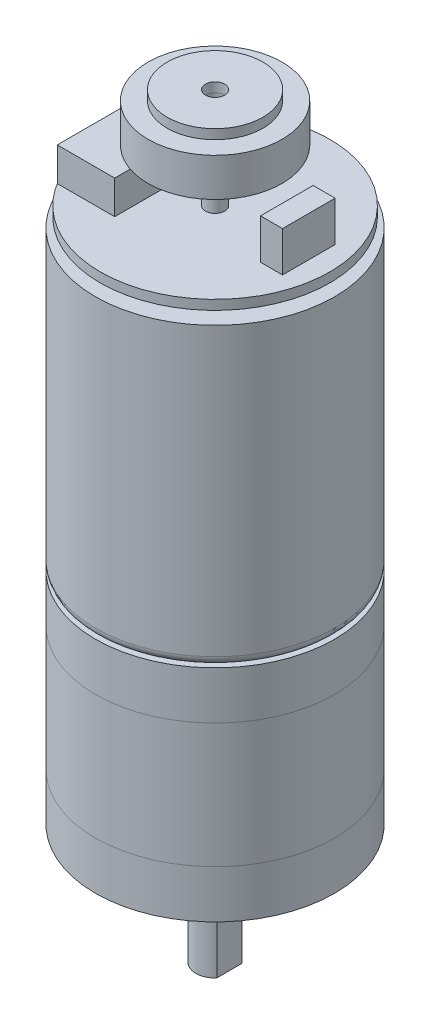
ISO-10303-21;
HEADER;
FILE_DESCRIPTION(('STEP AP214'),'2;1');
FILE_NAME('part.step','',(''),(''),'','','');
FILE_SCHEMA(('AUTOMOTIVE_DESIGN { 1 0 10303 214 1 1 1 1 }'));
ENDSEC;
DATA;
#1=APPLICATION_CONTEXT('core data for automotive mechanical design processes');
#2=APPLICATION_PROTOCOL_DEFINITION('international standard','automotive_design',2000,#1);
#3=PRODUCT_CONTEXT('',#1,'mechanical');
#4=PRODUCT('Part','Part','',(#3));
#5=PRODUCT_RELATED_PRODUCT_CATEGORY('part','',(#4));
#6=PRODUCT_DEFINITION_FORMATION('','',#4);
#7=PRODUCT_DEFINITION_CONTEXT('part definition',#1,'design');
#8=PRODUCT_DEFINITION('design','',#6,#7);
#9=PRODUCT_DEFINITION_SHAPE('','',#8);
#10=(LENGTH_UNIT() NAMED_UNIT(*) SI_UNIT(.MILLI.,.METRE.));
#11=(NAMED_UNIT(*) PLANE_ANGLE_UNIT() SI_UNIT($,.RADIAN.));
#12=(NAMED_UNIT(*) SI_UNIT($,.STERADIAN.) SOLID_ANGLE_UNIT());
#13=UNCERTAINTY_MEASURE_WITH_UNIT(LENGTH_MEASURE(1.E-05),#10,'distance_accuracy_value','');
#14=(GEOMETRIC_REPRESENTATION_CONTEXT(3) GLOBAL_UNCERTAINTY_ASSIGNED_CONTEXT((#13)) GLOBAL_UNIT_ASSIGNED_CONTEXT((#10,
#11,#12)) REPRESENTATION_CONTEXT('',''));
#15=CARTESIAN_POINT('',(0.,0.,0.));
#16=DIRECTION('',(0.,0.,1.));
#17=DIRECTION('',(1.,0.,0.));
#18=AXIS2_PLACEMENT_3D('',#15,#16,#17);
#19=CARTESIAN_POINT('',(9.8,60.2,2.75));
#20=DIRECTION('',(-1.,0.,0.));
#21=DIRECTION('',(0.,0.,1.));
#22=AXIS2_PLACEMENT_3D('',#19,#20,#21);
#23=PLANE('',#22);
#24=DIRECTION('',(0.,0.,-1.));
#25=VECTOR('',#24,1.);
#26=CARTESIAN_POINT('',(9.8,56.,2.75));
#27=LINE('',#26,#25);
#28=CARTESIAN_POINT('',(9.8,56.,2.75));
#29=VERTEX_POINT('',#28);
#30=CARTESIAN_POINT('',(9.8,56.,-2.75));
#31=VERTEX_POINT('',#30);
#32=EDGE_CURVE('E110',#29,#31,#27,.T.);
#33=ORIENTED_EDGE('',*,*,#32,.T.);
#34=DIRECTION('',(0.,-1.,0.));
#35=VECTOR('',#34,1.);
#36=CARTESIAN_POINT('',(9.8,60.2,-2.75));
#37=LINE('',#36,#35);
#38=CARTESIAN_POINT('',(9.8,60.2,-2.75));
#39=VERTEX_POINT('',#38);
#40=EDGE_CURVE('E12',#39,#31,#37,.T.);
#41=ORIENTED_EDGE('',*,*,#40,.F.);
#42=DIRECTION('',(0.,0.,-1.));
#43=VECTOR('',#42,1.);
#44=CARTESIAN_POINT('',(9.8,60.2,2.75));
#45=LINE('',#44,#43);
#46=CARTESIAN_POINT('',(9.8,60.2,2.75));
#47=VERTEX_POINT('',#46);
#48=EDGE_CURVE('E98',#47,#39,#45,.T.);
#49=ORIENTED_EDGE('',*,*,#48,.F.);
#50=DIRECTION('',(0.,-1.,0.));
#51=VECTOR('',#50,1.);
#52=CARTESIAN_POINT('',(9.8,60.2,2.75));
#53=LINE('',#52,#51);
#54=EDGE_CURVE('E106',#47,#29,#53,.T.);
#55=ORIENTED_EDGE('',*,*,#54,.T.);
#56=EDGE_LOOP('',(#33,#41,#49,#55));
#57=FACE_BOUND('',#56,.T.);
#58=ADVANCED_FACE('F47',(#57),#23,.F.);
#59=CARTESIAN_POINT('',(7.5,60.2,-2.75));
#60=DIRECTION('',(0.,0.,1.));
#61=DIRECTION('',(1.,0.,0.));
#62=AXIS2_PLACEMENT_3D('',#59,#60,#61);
#63=PLANE('',#62);
#64=DIRECTION('',(-1.,0.,0.));
#65=VECTOR('',#64,1.);
#66=CARTESIAN_POINT('',(7.5,56.,-2.75));
#67=LINE('',#66,#65);
#68=CARTESIAN_POINT('',(7.5,56.,-2.75));
#69=VERTEX_POINT('',#68);
#70=EDGE_CURVE('E102',#31,#69,#67,.T.);
#71=ORIENTED_EDGE('',*,*,#70,.T.);
#72=DIRECTION('',(0.,-1.,0.));
#73=VECTOR('',#72,1.);
#74=CARTESIAN_POINT('',(7.5,60.2,-2.75));
#75=LINE('',#74,#73);
#76=CARTESIAN_POINT('',(7.5,60.2,-2.75));
#77=VERTEX_POINT('',#76);
#78=EDGE_CURVE('E55',#77,#69,#75,.T.);
#79=ORIENTED_EDGE('',*,*,#78,.F.);
#80=DIRECTION('',(-1.,0.,0.));
#81=VECTOR('',#80,1.);
#82=CARTESIAN_POINT('',(7.5,60.2,-2.75));
#83=LINE('',#82,#81);
#84=EDGE_CURVE('E93',#39,#77,#83,.T.);
#85=ORIENTED_EDGE('',*,*,#84,.F.);
#86=ORIENTED_EDGE('',*,*,#40,.T.);
#87=EDGE_LOOP('',(#71,#79,#85,#86));
#88=FACE_BOUND('',#87,.T.);
#89=ADVANCED_FACE('F101',(#88),#63,.F.);
#90=CARTESIAN_POINT('',(7.5,60.2,2.75));
#91=DIRECTION('',(1.,0.,0.));
#92=DIRECTION('',(0.,0.,-1.));
#93=AXIS2_PLACEMENT_3D('',#90,#91,#92);
#94=PLANE('',#93);
#95=DIRECTION('',(0.,0.,1.));
#96=VECTOR('',#95,1.);
#97=CARTESIAN_POINT('',(7.5,56.,2.75));
#98=LINE('',#97,#96);
#99=CARTESIAN_POINT('',(7.5,56.,2.75));
#100=VERTEX_POINT('',#99);
#101=EDGE_CURVE('E80',#69,#100,#98,.T.);
#102=ORIENTED_EDGE('',*,*,#101,.T.);
#103=DIRECTION('',(0.,-1.,0.));
#104=VECTOR('',#103,1.);
#105=CARTESIAN_POINT('',(7.5,60.2,2.75));
#106=LINE('',#105,#104);
#107=CARTESIAN_POINT('',(7.5,60.2,2.75));
#108=VERTEX_POINT('',#107);
#109=EDGE_CURVE('E103',#108,#100,#106,.T.);
#110=ORIENTED_EDGE('',*,*,#109,.F.);
#111=DIRECTION('',(0.,0.,1.));
#112=VECTOR('',#111,1.);
#113=CARTESIAN_POINT('',(7.5,60.2,2.75));
#114=LINE('',#113,#112);
#115=EDGE_CURVE('E96',#77,#108,#114,.T.);
#116=ORIENTED_EDGE('',*,*,#115,.F.);
#117=ORIENTED_EDGE('',*,*,#78,.T.);
#118=EDGE_LOOP('',(#102,#110,#116,#117));
#119=FACE_BOUND('',#118,.T.);
#120=ADVANCED_FACE('F104',(#119),#94,.F.);
#121=CARTESIAN_POINT('',(7.5,60.2,2.75));
#122=DIRECTION('',(0.,0.,-1.));
#123=DIRECTION('',(-1.,0.,0.));
#124=AXIS2_PLACEMENT_3D('',#121,#122,#123);
#125=PLANE('',#124);
#126=DIRECTION('',(1.,0.,0.));
#127=VECTOR('',#126,1.);
#128=CARTESIAN_POINT('',(7.5,56.,2.75));
#129=LINE('',#128,#127);
#130=EDGE_CURVE('E86',#100,#29,#129,.T.);
#131=ORIENTED_EDGE('',*,*,#130,.T.);
#132=ORIENTED_EDGE('',*,*,#54,.F.);
#133=DIRECTION('',(1.,0.,0.));
#134=VECTOR('',#133,1.);
#135=CARTESIAN_POINT('',(7.5,60.2,2.75));
#136=LINE('',#135,#134);
#137=EDGE_CURVE('E63',#108,#47,#136,.T.);
#138=ORIENTED_EDGE('',*,*,#137,.F.);
#139=ORIENTED_EDGE('',*,*,#109,.T.);
#140=EDGE_LOOP('',(#131,#132,#138,#139));
#141=FACE_BOUND('',#140,.T.);
#142=ADVANCED_FACE('F117',(#141),#125,.F.);
#143=CARTESIAN_POINT('',(0.,60.2,0.));
#144=DIRECTION('',(0.,-1.,0.));
#145=DIRECTION('',(0.,0.,-1.));
#146=AXIS2_PLACEMENT_3D('',#143,#144,#145);
#147=PLANE('',#146);
#148=ORIENTED_EDGE('',*,*,#48,.T.);
#149=ORIENTED_EDGE('',*,*,#84,.T.);
#150=ORIENTED_EDGE('',*,*,#115,.T.);
#151=ORIENTED_EDGE('',*,*,#137,.T.);
#152=EDGE_LOOP('',(#148,#149,#150,#151));
#153=FACE_BOUND('',#152,.T.);
#154=ADVANCED_FACE('F94',(#153),#147,.F.);
#155=CARTESIAN_POINT('',(0.,56.,0.));
#156=DIRECTION('',(0.,-1.,0.));
#157=DIRECTION('',(0.,0.,-1.));
#158=AXIS2_PLACEMENT_3D('',#155,#156,#157);
#159=PLANE('',#158);
#160=ORIENTED_EDGE('',*,*,#32,.F.);
#161=ORIENTED_EDGE('',*,*,#130,.F.);
#162=ORIENTED_EDGE('',*,*,#101,.F.);
#163=ORIENTED_EDGE('',*,*,#70,.F.);
#164=EDGE_LOOP('',(#160,#161,#162,#163));
#165=FACE_BOUND('',#164,.T.);
#166=ADVANCED_FACE('F120',(#165),#159,.T.);
#167=CLOSED_SHELL('',(#58,#89,#120,#142,#154,#166));
#168=MANIFOLD_SOLID_BREP('B2',#167);
#169=CARTESIAN_POINT('',(-4.24390062427394,59.5,6.25));
#170=DIRECTION('',(-1.,0.,0.));
#171=DIRECTION('',(0.,0.,1.));
#172=AXIS2_PLACEMENT_3D('',#169,#170,#171);
#173=PLANE('',#172);
#174=DIRECTION('',(0.,0.,-1.));
#175=VECTOR('',#174,1.);
#176=CARTESIAN_POINT('',(-4.24390062427394,56.,6.25));
#177=LINE('',#176,#175);
#178=CARTESIAN_POINT('',(-4.24390062427394,56.,6.25));
#179=VERTEX_POINT('',#178);
#180=CARTESIAN_POINT('',(-4.24390062427394,56.,-6.25));
#181=VERTEX_POINT('',#180);
#182=EDGE_CURVE('E243',#179,#181,#177,.T.);
#183=ORIENTED_EDGE('',*,*,#182,.T.);
#184=DIRECTION('',(0.,-1.,0.));
#185=VECTOR('',#184,1.);
#186=CARTESIAN_POINT('',(-4.24390062427394,59.5,-6.25));
#187=LINE('',#186,#185);
#188=CARTESIAN_POINT('',(-4.24390062427394,59.5,-6.25));
#189=VERTEX_POINT('',#188);
#190=EDGE_CURVE('E45',#189,#181,#187,.T.);
#191=ORIENTED_EDGE('',*,*,#190,.F.);
#192=DIRECTION('',(0.,0.,-1.));
#193=VECTOR('',#192,1.);
#194=CARTESIAN_POINT('',(-4.24390062427394,59.5,6.25));
#195=LINE('',#194,#193);
#196=CARTESIAN_POINT('',(-4.24390062427394,59.5,6.25));
#197=VERTEX_POINT('',#196);
#198=EDGE_CURVE('E231',#197,#189,#195,.T.);
#199=ORIENTED_EDGE('',*,*,#198,.F.);
#200=DIRECTION('',(0.,-1.,0.));
#201=VECTOR('',#200,1.);
#202=CARTESIAN_POINT('',(-4.24390062427394,59.5,6.25));
#203=LINE('',#202,#201);
#204=EDGE_CURVE('E239',#197,#179,#203,.T.);
#205=ORIENTED_EDGE('',*,*,#204,.T.);
#206=EDGE_LOOP('',(#183,#191,#199,#205));
#207=FACE_BOUND('',#206,.T.);
#208=ADVANCED_FACE('F180',(#207),#173,.F.);
#209=CARTESIAN_POINT('',(-10.2439006242739,59.5,-6.25));
#210=DIRECTION('',(0.,0.,1.));
#211=DIRECTION('',(1.,0.,0.));
#212=AXIS2_PLACEMENT_3D('',#209,#210,#211);
#213=PLANE('',#212);
#214=DIRECTION('',(-1.,0.,0.));
#215=VECTOR('',#214,1.);
#216=CARTESIAN_POINT('',(-10.2439006242739,56.,-6.25));
#217=LINE('',#216,#215);
#218=CARTESIAN_POINT('',(-10.2439006242739,56.,-6.25));
#219=VERTEX_POINT('',#218);
#220=EDGE_CURVE('E235',#181,#219,#217,.T.);
#221=ORIENTED_EDGE('',*,*,#220,.T.);
#222=DIRECTION('',(0.,-1.,0.));
#223=VECTOR('',#222,1.);
#224=CARTESIAN_POINT('',(-10.2439006242739,59.5,-6.25));
#225=LINE('',#224,#223);
#226=CARTESIAN_POINT('',(-10.2439006242739,59.5,-6.25));
#227=VERTEX_POINT('',#226);
#228=EDGE_CURVE('E188',#227,#219,#225,.T.);
#229=ORIENTED_EDGE('',*,*,#228,.F.);
#230=DIRECTION('',(-1.,0.,0.));
#231=VECTOR('',#230,1.);
#232=CARTESIAN_POINT('',(-10.2439006242739,59.5,-6.25));
#233=LINE('',#232,#231);
#234=EDGE_CURVE('E226',#189,#227,#233,.T.);
#235=ORIENTED_EDGE('',*,*,#234,.F.);
#236=ORIENTED_EDGE('',*,*,#190,.T.);
#237=EDGE_LOOP('',(#221,#229,#235,#236));
#238=FACE_BOUND('',#237,.T.);
#239=ADVANCED_FACE('F234',(#238),#213,.F.);
#240=CARTESIAN_POINT('',(-10.2439006242739,59.5,6.25));
#241=DIRECTION('',(1.,0.,0.));
#242=DIRECTION('',(0.,0.,-1.));
#243=AXIS2_PLACEMENT_3D('',#240,#241,#242);
#244=PLANE('',#243);
#245=DIRECTION('',(0.,0.,1.));
#246=VECTOR('',#245,1.);
#247=CARTESIAN_POINT('',(-10.2439006242739,56.,6.25));
#248=LINE('',#247,#246);
#249=CARTESIAN_POINT('',(-10.2439006242739,56.,6.25));
#250=VERTEX_POINT('',#249);
#251=EDGE_CURVE('E213',#219,#250,#248,.T.);
#252=ORIENTED_EDGE('',*,*,#251,.T.);
#253=DIRECTION('',(0.,-1.,0.));
#254=VECTOR('',#253,1.);
#255=CARTESIAN_POINT('',(-10.2439006242739,59.5,6.25));
#256=LINE('',#255,#254);
#257=CARTESIAN_POINT('',(-10.2439006242739,59.5,6.25));
#258=VERTEX_POINT('',#257);
#259=EDGE_CURVE('E236',#258,#250,#256,.T.);
#260=ORIENTED_EDGE('',*,*,#259,.F.);
#261=DIRECTION('',(0.,0.,1.));
#262=VECTOR('',#261,1.);
#263=CARTESIAN_POINT('',(-10.2439006242739,59.5,6.25));
#264=LINE('',#263,#262);
#265=EDGE_CURVE('E229',#227,#258,#264,.T.);
#266=ORIENTED_EDGE('',*,*,#265,.F.);
#267=ORIENTED_EDGE('',*,*,#228,.T.);
#268=EDGE_LOOP('',(#252,#260,#266,#267));
#269=FACE_BOUND('',#268,.T.);
#270=ADVANCED_FACE('F237',(#269),#244,.F.);
#271=CARTESIAN_POINT('',(-10.2439006242739,59.5,6.25));
#272=DIRECTION('',(0.,0.,-1.));
#273=DIRECTION('',(-1.,0.,0.));
#274=AXIS2_PLACEMENT_3D('',#271,#272,#273);
#275=PLANE('',#274);
#276=DIRECTION('',(1.,0.,0.));
#277=VECTOR('',#276,1.);
#278=CARTESIAN_POINT('',(-10.2439006242739,56.,6.25));
#279=LINE('',#278,#277);
#280=EDGE_CURVE('E219',#250,#179,#279,.T.);
#281=ORIENTED_EDGE('',*,*,#280,.T.);
#282=ORIENTED_EDGE('',*,*,#204,.F.);
#283=DIRECTION('',(1.,0.,0.));
#284=VECTOR('',#283,1.);
#285=CARTESIAN_POINT('',(-10.2439006242739,59.5,6.25));
#286=LINE('',#285,#284);
#287=EDGE_CURVE('E196',#258,#197,#286,.T.);
#288=ORIENTED_EDGE('',*,*,#287,.F.);
#289=ORIENTED_EDGE('',*,*,#259,.T.);
#290=EDGE_LOOP('',(#281,#282,#288,#289));
#291=FACE_BOUND('',#290,.T.);
#292=ADVANCED_FACE('F250',(#291),#275,.F.);
#293=CARTESIAN_POINT('',(0.,59.5,0.));
#294=DIRECTION('',(0.,-1.,0.));
#295=DIRECTION('',(0.,0.,-1.));
#296=AXIS2_PLACEMENT_3D('',#293,#294,#295);
#297=PLANE('',#296);
#298=ORIENTED_EDGE('',*,*,#198,.T.);
#299=ORIENTED_EDGE('',*,*,#234,.T.);
#300=ORIENTED_EDGE('',*,*,#265,.T.);
#301=ORIENTED_EDGE('',*,*,#287,.T.);
#302=EDGE_LOOP('',(#298,#299,#300,#301));
#303=FACE_BOUND('',#302,.T.);
#304=ADVANCED_FACE('F227',(#303),#297,.F.);
#305=CARTESIAN_POINT('',(0.,56.,0.));
#306=DIRECTION('',(0.,-1.,0.));
#307=DIRECTION('',(0.,0.,-1.));
#308=AXIS2_PLACEMENT_3D('',#305,#306,#307);
#309=PLANE('',#308);
#310=ORIENTED_EDGE('',*,*,#182,.F.);
#311=ORIENTED_EDGE('',*,*,#280,.F.);
#312=ORIENTED_EDGE('',*,*,#251,.F.);
#313=ORIENTED_EDGE('',*,*,#220,.F.);
#314=EDGE_LOOP('',(#310,#311,#312,#313));
#315=FACE_BOUND('',#314,.T.);
#316=ADVANCED_FACE('F253',(#315),#309,.T.);
#317=CLOSED_SHELL('',(#208,#239,#270,#292,#304,#316));
#318=MANIFOLD_SOLID_BREP('B6',#317);
#319=CARTESIAN_POINT('',(0.,-12.5,0.));
#320=DIRECTION('',(0.,1.,0.));
#321=DIRECTION('',(0.,0.,1.));
#322=AXIS2_PLACEMENT_3D('',#319,#320,#321);
#323=CYLINDRICAL_SURFACE('',#322,2.);
#324=CARTESIAN_POINT('',(0.,-12.5,0.));
#325=DIRECTION('',(0.,-1.,0.));
#326=DIRECTION('',(0.,0.,-1.));
#327=AXIS2_PLACEMENT_3D('',#324,#325,#326);
#328=CIRCLE('',#327,2.);
#329=CARTESIAN_POINT('',(1.5,-12.5,1.3228756555323));
#330=VERTEX_POINT('',#329);
#331=CARTESIAN_POINT('',(1.5,-12.5,-1.32287565553229));
#332=VERTEX_POINT('',#331);
#333=EDGE_CURVE('E178',#330,#332,#328,.T.);
#334=ORIENTED_EDGE('',*,*,#333,.F.);
#335=DIRECTION('',(0.,-1.,0.));
#336=VECTOR('',#335,1.);
#337=CARTESIAN_POINT('',(1.5,-4.7,1.3228756555323));
#338=LINE('',#337,#336);
#339=CARTESIAN_POINT('',(1.5,-4.7,1.3228756555323));
#340=VERTEX_POINT('',#339);
#341=EDGE_CURVE('E325',#340,#330,#338,.T.);
#342=ORIENTED_EDGE('',*,*,#341,.F.);
#343=CARTESIAN_POINT('',(0.,-4.7,0.));
#344=DIRECTION('',(0.,-1.,0.));
#345=DIRECTION('',(0.,0.,-1.));
#346=AXIS2_PLACEMENT_3D('',#343,#344,#345);
#347=CIRCLE('',#346,2.);
#348=CARTESIAN_POINT('',(1.5,-4.7,-1.32287565553229));
#349=VERTEX_POINT('',#348);
#350=EDGE_CURVE('E340',#349,#340,#347,.T.);
#351=ORIENTED_EDGE('',*,*,#350,.F.);
#352=DIRECTION('',(0.,-1.,0.));
#353=VECTOR('',#352,1.);
#354=CARTESIAN_POINT('',(1.5,-4.7,-1.32287565553229));
#355=LINE('',#354,#353);
#356=EDGE_CURVE('E331',#349,#332,#355,.T.);
#357=ORIENTED_EDGE('',*,*,#356,.T.);
#358=EDGE_LOOP('',(#334,#342,#351,#357));
#359=FACE_BOUND('',#358,.T.);
#360=CARTESIAN_POINT('',(0.,-2.5,0.));
#361=DIRECTION('',(0.,-1.,0.));
#362=DIRECTION('',(0.,0.,-1.));
#363=AXIS2_PLACEMENT_3D('',#360,#361,#362);
#364=CIRCLE('',#363,2.);
#365=CARTESIAN_POINT('',(0.,-2.5,-2.));
#366=VERTEX_POINT('',#365);
#367=EDGE_CURVE('E314',#366,#366,#364,.T.);
#368=ORIENTED_EDGE('',*,*,#367,.T.);
#369=EDGE_LOOP('',(#368));
#370=FACE_BOUND('',#369,.T.);
#371=ADVANCED_FACE('F311',(#359,#370),#323,.T.);
#372=CARTESIAN_POINT('',(0.,-12.5,0.));
#373=DIRECTION('',(0.,-1.,0.));
#374=DIRECTION('',(0.,0.,-1.));
#375=AXIS2_PLACEMENT_3D('',#372,#373,#374);
#376=PLANE('',#375);
#377=DIRECTION('',(0.,0.,-1.));
#378=VECTOR('',#377,1.);
#379=CARTESIAN_POINT('',(1.5,-12.5,1.3228756555323));
#380=LINE('',#379,#378);
#381=EDGE_CURVE('E336',#330,#332,#380,.T.);
#382=ORIENTED_EDGE('',*,*,#381,.F.);
#383=ORIENTED_EDGE('',*,*,#333,.T.);
#384=EDGE_LOOP('',(#382,#383));
#385=FACE_BOUND('',#384,.T.);
#386=ADVANCED_FACE('F346',(#385),#376,.T.);
#387=CARTESIAN_POINT('',(0.,-2.5,0.));
#388=DIRECTION('',(0.,-1.,0.));
#389=DIRECTION('',(0.,0.,-1.));
#390=AXIS2_PLACEMENT_3D('',#387,#388,#389);
#391=PLANE('',#390);
#392=ORIENTED_EDGE('',*,*,#367,.F.);
#393=EDGE_LOOP('',(#392));
#394=FACE_BOUND('',#393,.T.);
#395=ADVANCED_FACE('F348',(#394),#391,.F.);
#396=CARTESIAN_POINT('',(1.5,-4.7,1.3228756555323));
#397=DIRECTION('',(-1.,0.,0.));
#398=DIRECTION('',(0.,0.,1.));
#399=AXIS2_PLACEMENT_3D('',#396,#397,#398);
#400=PLANE('',#399);
#401=ORIENTED_EDGE('',*,*,#381,.T.);
#402=ORIENTED_EDGE('',*,*,#356,.F.);
#403=DIRECTION('',(0.,0.,-1.));
#404=VECTOR('',#403,1.);
#405=CARTESIAN_POINT('',(1.5,-4.7,1.3228756555323));
#406=LINE('',#405,#404);
#407=EDGE_CURVE('E363',#340,#349,#406,.T.);
#408=ORIENTED_EDGE('',*,*,#407,.F.);
#409=ORIENTED_EDGE('',*,*,#341,.T.);
#410=EDGE_LOOP('',(#401,#402,#408,#409));
#411=FACE_BOUND('',#410,.T.);
#412=ADVANCED_FACE('F337',(#411),#400,.F.);
#413=CARTESIAN_POINT('',(0.,-4.7,0.));
#414=DIRECTION('',(0.,-1.,0.));
#415=DIRECTION('',(0.,0.,-1.));
#416=AXIS2_PLACEMENT_3D('',#413,#414,#415);
#417=PLANE('',#416);
#418=ORIENTED_EDGE('',*,*,#350,.T.);
#419=ORIENTED_EDGE('',*,*,#407,.T.);
#420=EDGE_LOOP('',(#418,#419));
#421=FACE_BOUND('',#420,.T.);
#422=ADVANCED_FACE('F358',(#421),#417,.T.);
#423=CLOSED_SHELL('',(#371,#386,#395,#412,#422));
#424=MANIFOLD_SOLID_BREP('B39',#423);
#425=CARTESIAN_POINT('',(0.,-2.5,0.));
#426=DIRECTION('',(0.,1.,0.));
#427=DIRECTION('',(0.,0.,1.));
#428=AXIS2_PLACEMENT_3D('',#425,#426,#427);
#429=CYLINDRICAL_SURFACE('',#428,3.5);
#430=CARTESIAN_POINT('',(0.,-2.5,0.));
#431=DIRECTION('',(0.,-1.,0.));
#432=DIRECTION('',(0.,0.,-1.));
#433=AXIS2_PLACEMENT_3D('',#430,#431,#432);
#434=CIRCLE('',#433,3.5);
#435=CARTESIAN_POINT('',(0.,-2.5,-3.5));
#436=VERTEX_POINT('',#435);
#437=EDGE_CURVE('E310',#436,#436,#434,.T.);
#438=ORIENTED_EDGE('',*,*,#437,.F.);
#439=EDGE_LOOP('',(#438));
#440=FACE_BOUND('',#439,.T.);
#441=CARTESIAN_POINT('',(0.,0.,0.));
#442=DIRECTION('',(0.,-1.,0.));
#443=DIRECTION('',(0.,0.,-1.));
#444=AXIS2_PLACEMENT_3D('',#441,#442,#443);
#445=CIRCLE('',#444,3.5);
#446=CARTESIAN_POINT('',(0.,0.,-3.5));
#447=VERTEX_POINT('',#446);
#448=EDGE_CURVE('E408',#447,#447,#445,.T.);
#449=ORIENTED_EDGE('',*,*,#448,.T.);
#450=EDGE_LOOP('',(#449));
#451=FACE_BOUND('',#450,.T.);
#452=ADVANCED_FACE('F405',(#440,#451),#429,.T.);
#453=CARTESIAN_POINT('',(0.,-2.5,0.));
#454=DIRECTION('',(0.,-1.,0.));
#455=DIRECTION('',(0.,0.,-1.));
#456=AXIS2_PLACEMENT_3D('',#453,#454,#455);
#457=PLANE('',#456);
#458=ORIENTED_EDGE('',*,*,#437,.T.);
#459=EDGE_LOOP('',(#458));
#460=FACE_BOUND('',#459,.T.);
#461=ADVANCED_FACE('F420',(#460),#457,.T.);
#462=CARTESIAN_POINT('',(0.,0.,0.));
#463=DIRECTION('',(0.,-1.,0.));
#464=DIRECTION('',(0.,0.,-1.));
#465=AXIS2_PLACEMENT_3D('',#462,#463,#464);
#466=PLANE('',#465);
#467=ORIENTED_EDGE('',*,*,#448,.F.);
#468=EDGE_LOOP('',(#467));
#469=FACE_BOUND('',#468,.T.);
#470=ADVANCED_FACE('F418',(#469),#466,.F.);
#471=CLOSED_SHELL('',(#452,#461,#470));
#472=MANIFOLD_SOLID_BREP('B172',#471);
#473=CARTESIAN_POINT('',(0.,66.5,0.));
#474=DIRECTION('',(0.,-1.,0.));
#475=DIRECTION('',(0.,0.,-1.));
#476=AXIS2_PLACEMENT_3D('',#473,#474,#475);
#477=CYLINDRICAL_SURFACE('',#476,5.);
#478=CARTESIAN_POINT('',(0.,66.5,0.));
#479=DIRECTION('',(0.,1.,0.));
#480=DIRECTION('',(0.,0.,1.));
#481=AXIS2_PLACEMENT_3D('',#478,#479,#480);
#482=CIRCLE('',#481,5.);
#483=CARTESIAN_POINT('',(0.,66.5,5.));
#484=VERTEX_POINT('',#483);
#485=EDGE_CURVE('E404',#484,#484,#482,.T.);
#486=ORIENTED_EDGE('',*,*,#485,.F.);
#487=EDGE_LOOP('',(#486));
#488=FACE_BOUND('',#487,.T.);
#489=CARTESIAN_POINT('',(0.,65.5,0.));
#490=DIRECTION('',(0.,1.,0.));
#491=DIRECTION('',(0.,0.,1.));
#492=AXIS2_PLACEMENT_3D('',#489,#490,#491);
#493=CIRCLE('',#492,5.);
#494=CARTESIAN_POINT('',(0.,65.5,5.));
#495=VERTEX_POINT('',#494);
#496=EDGE_CURVE('E460',#495,#495,#493,.T.);
#497=ORIENTED_EDGE('',*,*,#496,.T.);
#498=EDGE_LOOP('',(#497));
#499=FACE_BOUND('',#498,.T.);
#500=ADVANCED_FACE('F453',(#488,#499),#477,.T.);
#501=CARTESIAN_POINT('',(0.,66.5,0.));
#502=DIRECTION('',(0.,1.,0.));
#503=DIRECTION('',(0.,0.,1.));
#504=AXIS2_PLACEMENT_3D('',#501,#502,#503);
#505=PLANE('',#504);
#506=CARTESIAN_POINT('',(0.,66.5,0.));
#507=DIRECTION('',(0.,1.,0.));
#508=DIRECTION('',(0.,0.,1.));
#509=AXIS2_PLACEMENT_3D('',#506,#507,#508);
#510=CIRCLE('',#509,1.);
#511=CARTESIAN_POINT('',(0.,66.5,1.));
#512=VERTEX_POINT('',#511);
#513=EDGE_CURVE('E466',#512,#512,#510,.T.);
#514=ORIENTED_EDGE('',*,*,#513,.F.);
#515=EDGE_LOOP('',(#514));
#516=FACE_BOUND('',#515,.T.);
#517=ORIENTED_EDGE('',*,*,#485,.T.);
#518=EDGE_LOOP('',(#517));
#519=FACE_BOUND('',#518,.T.);
#520=ADVANCED_FACE('F482',(#516,#519),#505,.T.);
#521=CARTESIAN_POINT('',(0.,65.5,0.));
#522=DIRECTION('',(0.,1.,0.));
#523=DIRECTION('',(0.,0.,1.));
#524=AXIS2_PLACEMENT_3D('',#521,#522,#523);
#525=PLANE('',#524);
#526=CARTESIAN_POINT('',(0.,65.5,0.));
#527=DIRECTION('',(0.,1.,0.));
#528=DIRECTION('',(0.,0.,1.));
#529=AXIS2_PLACEMENT_3D('',#526,#527,#528);
#530=CIRCLE('',#529,1.);
#531=CARTESIAN_POINT('',(0.,65.5,1.));
#532=VERTEX_POINT('',#531);
#533=EDGE_CURVE('E456',#532,#532,#530,.T.);
#534=ORIENTED_EDGE('',*,*,#533,.T.);
#535=EDGE_LOOP('',(#534));
#536=FACE_BOUND('',#535,.T.);
#537=ORIENTED_EDGE('',*,*,#496,.F.);
#538=EDGE_LOOP('',(#537));
#539=FACE_BOUND('',#538,.T.);
#540=ADVANCED_FACE('F473',(#536,#539),#525,.F.);
#541=CARTESIAN_POINT('',(0.,64.5,0.));
#542=DIRECTION('',(0.,1.,0.));
#543=DIRECTION('',(0.,0.,1.));
#544=AXIS2_PLACEMENT_3D('',#541,#542,#543);
#545=CYLINDRICAL_SURFACE('',#544,1.);
#546=ORIENTED_EDGE('',*,*,#513,.T.);
#547=EDGE_LOOP('',(#546));
#548=FACE_BOUND('',#547,.T.);
#549=ORIENTED_EDGE('',*,*,#533,.F.);
#550=EDGE_LOOP('',(#549));
#551=FACE_BOUND('',#550,.T.);
#552=ADVANCED_FACE('F476',(#548,#551),#545,.F.);
#553=CLOSED_SHELL('',(#500,#520,#540,#552));
#554=MANIFOLD_SOLID_BREP('B305',#553);
#555=CARTESIAN_POINT('',(0.,65.5,0.));
#556=DIRECTION('',(0.,-1.,0.));
#557=DIRECTION('',(0.,0.,-1.));
#558=AXIS2_PLACEMENT_3D('',#555,#556,#557);
#559=CYLINDRICAL_SURFACE('',#558,7.);
#560=CARTESIAN_POINT('',(0.,65.5,0.));
#561=DIRECTION('',(0.,1.,0.));
#562=DIRECTION('',(0.,0.,1.));
#563=AXIS2_PLACEMENT_3D('',#560,#561,#562);
#564=CIRCLE('',#563,7.);
#565=CARTESIAN_POINT('',(0.,65.5,7.));
#566=VERTEX_POINT('',#565);
#567=EDGE_CURVE('E452',#566,#566,#564,.T.);
#568=ORIENTED_EDGE('',*,*,#567,.F.);
#569=EDGE_LOOP('',(#568));
#570=FACE_BOUND('',#569,.T.);
#571=CARTESIAN_POINT('',(0.,61.5,0.));
#572=DIRECTION('',(0.,1.,0.));
#573=DIRECTION('',(0.,0.,1.));
#574=AXIS2_PLACEMENT_3D('',#571,#572,#573);
#575=CIRCLE('',#574,7.);
#576=CARTESIAN_POINT('',(0.,61.5,7.));
#577=VERTEX_POINT('',#576);
#578=EDGE_CURVE('E529',#577,#577,#575,.T.);
#579=ORIENTED_EDGE('',*,*,#578,.T.);
#580=EDGE_LOOP('',(#579));
#581=FACE_BOUND('',#580,.T.);
#582=ADVANCED_FACE('F522',(#570,#581),#559,.T.);
#583=CARTESIAN_POINT('',(0.,65.5,0.));
#584=DIRECTION('',(0.,1.,0.));
#585=DIRECTION('',(0.,0.,1.));
#586=AXIS2_PLACEMENT_3D('',#583,#584,#585);
#587=PLANE('',#586);
#588=CARTESIAN_POINT('',(0.,65.5,0.));
#589=DIRECTION('',(0.,1.,0.));
#590=DIRECTION('',(0.,0.,1.));
#591=AXIS2_PLACEMENT_3D('',#588,#589,#590);
#592=CIRCLE('',#591,1.);
#593=CARTESIAN_POINT('',(0.,65.5,1.));
#594=VERTEX_POINT('',#593);
#595=EDGE_CURVE('E525',#594,#594,#592,.T.);
#596=ORIENTED_EDGE('',*,*,#595,.F.);
#597=EDGE_LOOP('',(#596));
#598=FACE_BOUND('',#597,.T.);
#599=ORIENTED_EDGE('',*,*,#567,.T.);
#600=EDGE_LOOP('',(#599));
#601=FACE_BOUND('',#600,.T.);
#602=ADVANCED_FACE('F545',(#598,#601),#587,.T.);
#603=CARTESIAN_POINT('',(0.,61.5,0.));
#604=DIRECTION('',(0.,1.,0.));
#605=DIRECTION('',(0.,0.,1.));
#606=AXIS2_PLACEMENT_3D('',#603,#604,#605);
#607=PLANE('',#606);
#608=ORIENTED_EDGE('',*,*,#578,.F.);
#609=EDGE_LOOP('',(#608));
#610=FACE_BOUND('',#609,.T.);
#611=ADVANCED_FACE('F547',(#610),#607,.F.);
#612=CARTESIAN_POINT('',(0.,64.5,0.));
#613=DIRECTION('',(0.,1.,0.));
#614=DIRECTION('',(0.,0.,1.));
#615=AXIS2_PLACEMENT_3D('',#612,#613,#614);
#616=CYLINDRICAL_SURFACE('',#615,1.);
#617=ORIENTED_EDGE('',*,*,#595,.T.);
#618=EDGE_LOOP('',(#617));
#619=FACE_BOUND('',#618,.T.);
#620=CARTESIAN_POINT('',(0.,64.5,0.));
#621=DIRECTION('',(0.,1.,0.));
#622=DIRECTION('',(0.,0.,1.));
#623=AXIS2_PLACEMENT_3D('',#620,#621,#622);
#624=CIRCLE('',#623,1.);
#625=CARTESIAN_POINT('',(0.,64.5,1.));
#626=VERTEX_POINT('',#625);
#627=EDGE_CURVE('E535',#626,#626,#624,.T.);
#628=ORIENTED_EDGE('',*,*,#627,.F.);
#629=EDGE_LOOP('',(#628));
#630=FACE_BOUND('',#629,.T.);
#631=ADVANCED_FACE('F542',(#619,#630),#616,.F.);
#632=CARTESIAN_POINT('',(0.,64.5,0.));
#633=DIRECTION('',(0.,1.,0.));
#634=DIRECTION('',(0.,0.,1.));
#635=AXIS2_PLACEMENT_3D('',#632,#633,#634);
#636=PLANE('',#635);
#637=ORIENTED_EDGE('',*,*,#627,.T.);
#638=EDGE_LOOP('',(#637));
#639=FACE_BOUND('',#638,.T.);
#640=ADVANCED_FACE('F558',(#639),#636,.T.);
#641=CLOSED_SHELL('',(#582,#602,#611,#631,#640));
#642=MANIFOLD_SOLID_BREP('B399',#641);
#643=CARTESIAN_POINT('',(0.,61.5,0.));
#644=DIRECTION('',(0.,-1.,0.));
#645=DIRECTION('',(0.,0.,-1.));
#646=AXIS2_PLACEMENT_3D('',#643,#644,#645);
#647=CYLINDRICAL_SURFACE('',#646,4.);
#648=CARTESIAN_POINT('',(0.,61.5,0.));
#649=DIRECTION('',(0.,1.,0.));
#650=DIRECTION('',(0.,0.,1.));
#651=AXIS2_PLACEMENT_3D('',#648,#649,#650);
#652=CIRCLE('',#651,4.);
#653=CARTESIAN_POINT('',(0.,61.5,4.));
#654=VERTEX_POINT('',#653);
#655=EDGE_CURVE('E521',#654,#654,#652,.T.);
#656=ORIENTED_EDGE('',*,*,#655,.F.);
#657=EDGE_LOOP('',(#656));
#658=FACE_BOUND('',#657,.T.);
#659=CARTESIAN_POINT('',(0.,61.,0.));
#660=DIRECTION('',(0.,1.,0.));
#661=DIRECTION('',(0.,0.,1.));
#662=AXIS2_PLACEMENT_3D('',#659,#660,#661);
#663=CIRCLE('',#662,4.);
#664=CARTESIAN_POINT('',(0.,61.,4.));
#665=VERTEX_POINT('',#664);
#666=EDGE_CURVE('E603',#665,#665,#663,.T.);
#667=ORIENTED_EDGE('',*,*,#666,.T.);
#668=EDGE_LOOP('',(#667));
#669=FACE_BOUND('',#668,.T.);
#670=ADVANCED_FACE('F600',(#658,#669),#647,.T.);
#671=CARTESIAN_POINT('',(0.,61.5,0.));
#672=DIRECTION('',(0.,1.,0.));
#673=DIRECTION('',(0.,0.,1.));
#674=AXIS2_PLACEMENT_3D('',#671,#672,#673);
#675=PLANE('',#674);
#676=ORIENTED_EDGE('',*,*,#655,.T.);
#677=EDGE_LOOP('',(#676));
#678=FACE_BOUND('',#677,.T.);
#679=ADVANCED_FACE('F615',(#678),#675,.T.);
#680=CARTESIAN_POINT('',(0.,61.,0.));
#681=DIRECTION('',(0.,1.,0.));
#682=DIRECTION('',(0.,0.,1.));
#683=AXIS2_PLACEMENT_3D('',#680,#681,#682);
#684=PLANE('',#683);
#685=ORIENTED_EDGE('',*,*,#666,.F.);
#686=EDGE_LOOP('',(#685));
#687=FACE_BOUND('',#686,.T.);
#688=ADVANCED_FACE('F613',(#687),#684,.F.);
#689=CLOSED_SHELL('',(#670,#679,#688));
#690=MANIFOLD_SOLID_BREP('B447',#689);
#691=CARTESIAN_POINT('',(0.,61.,0.));
#692=DIRECTION('',(0.,-1.,0.));
#693=DIRECTION('',(0.,0.,-1.));
#694=AXIS2_PLACEMENT_3D('',#691,#692,#693);
#695=CYLINDRICAL_SURFACE('',#694,1.);
#696=CARTESIAN_POINT('',(0.,61.,0.));
#697=DIRECTION('',(0.,1.,0.));
#698=DIRECTION('',(0.,0.,1.));
#699=AXIS2_PLACEMENT_3D('',#696,#697,#698);
#700=CIRCLE('',#699,1.);
#701=CARTESIAN_POINT('',(0.,61.,1.));
#702=VERTEX_POINT('',#701);
#703=EDGE_CURVE('E599',#702,#702,#700,.T.);
#704=ORIENTED_EDGE('',*,*,#703,.F.);
#705=EDGE_LOOP('',(#704));
#706=FACE_BOUND('',#705,.T.);
#707=CARTESIAN_POINT('',(0.,56.,0.));
#708=DIRECTION('',(0.,1.,0.));
#709=DIRECTION('',(0.,0.,1.));
#710=AXIS2_PLACEMENT_3D('',#707,#708,#709);
#711=CIRCLE('',#710,1.);
#712=CARTESIAN_POINT('',(0.,56.,1.));
#713=VERTEX_POINT('',#712);
#714=EDGE_CURVE('E651',#713,#713,#711,.T.);
#715=ORIENTED_EDGE('',*,*,#714,.T.);
#716=EDGE_LOOP('',(#715));
#717=FACE_BOUND('',#716,.T.);
#718=ADVANCED_FACE('F648',(#706,#717),#695,.T.);
#719=CARTESIAN_POINT('',(0.,61.,0.));
#720=DIRECTION('',(0.,1.,0.));
#721=DIRECTION('',(0.,0.,1.));
#722=AXIS2_PLACEMENT_3D('',#719,#720,#721);
#723=PLANE('',#722);
#724=ORIENTED_EDGE('',*,*,#703,.T.);
#725=EDGE_LOOP('',(#724));
#726=FACE_BOUND('',#725,.T.);
#727=ADVANCED_FACE('F663',(#726),#723,.T.);
#728=CARTESIAN_POINT('',(0.,56.,0.));
#729=DIRECTION('',(0.,1.,0.));
#730=DIRECTION('',(0.,0.,1.));
#731=AXIS2_PLACEMENT_3D('',#728,#729,#730);
#732=PLANE('',#731);
#733=ORIENTED_EDGE('',*,*,#714,.F.);
#734=EDGE_LOOP('',(#733));
#735=FACE_BOUND('',#734,.T.);
#736=ADVANCED_FACE('F661',(#735),#732,.F.);
#737=CLOSED_SHELL('',(#718,#727,#736));
#738=MANIFOLD_SOLID_BREP('B516',#737);
#739=CARTESIAN_POINT('',(0.,56.,0.));
#740=DIRECTION('',(0.,-1.,0.));
#741=DIRECTION('',(0.,0.,-1.));
#742=AXIS2_PLACEMENT_3D('',#739,#740,#741);
#743=CYLINDRICAL_SURFACE('',#742,12.);
#744=CARTESIAN_POINT('',(0.,56.,0.));
#745=DIRECTION('',(0.,1.,0.));
#746=DIRECTION('',(0.,0.,1.));
#747=AXIS2_PLACEMENT_3D('',#744,#745,#746);
#748=CIRCLE('',#747,12.);
#749=CARTESIAN_POINT('',(0.,56.,12.));
#750=VERTEX_POINT('',#749);
#751=EDGE_CURVE('E647',#750,#750,#748,.T.);
#752=ORIENTED_EDGE('',*,*,#751,.F.);
#753=EDGE_LOOP('',(#752));
#754=FACE_BOUND('',#753,.T.);
#755=CARTESIAN_POINT('',(0.,55.,0.));
#756=DIRECTION('',(0.,1.,0.));
#757=DIRECTION('',(0.,0.,1.));
#758=AXIS2_PLACEMENT_3D('',#755,#756,#757);
#759=CIRCLE('',#758,12.);
#760=CARTESIAN_POINT('',(0.,55.,12.));
#761=VERTEX_POINT('',#760);
#762=EDGE_CURVE('E699',#761,#761,#759,.T.);
#763=ORIENTED_EDGE('',*,*,#762,.T.);
#764=EDGE_LOOP('',(#763));
#765=FACE_BOUND('',#764,.T.);
#766=ADVANCED_FACE('F696',(#754,#765),#743,.T.);
#767=CARTESIAN_POINT('',(0.,56.,0.));
#768=DIRECTION('',(0.,1.,0.));
#769=DIRECTION('',(0.,0.,1.));
#770=AXIS2_PLACEMENT_3D('',#767,#768,#769);
#771=PLANE('',#770);
#772=ORIENTED_EDGE('',*,*,#751,.T.);
#773=EDGE_LOOP('',(#772));
#774=FACE_BOUND('',#773,.T.);
#775=ADVANCED_FACE('F711',(#774),#771,.T.);
#776=CARTESIAN_POINT('',(0.,55.,0.));
#777=DIRECTION('',(0.,1.,0.));
#778=DIRECTION('',(0.,0.,1.));
#779=AXIS2_PLACEMENT_3D('',#776,#777,#778);
#780=PLANE('',#779);
#781=ORIENTED_EDGE('',*,*,#762,.F.);
#782=EDGE_LOOP('',(#781));
#783=FACE_BOUND('',#782,.T.);
#784=ADVANCED_FACE('F709',(#783),#780,.F.);
#785=CLOSED_SHELL('',(#766,#775,#784));
#786=MANIFOLD_SOLID_BREP('B594',#785);
#787=CARTESIAN_POINT('',(0.,55.,0.));
#788=DIRECTION('',(0.,-1.,0.));
#789=DIRECTION('',(0.,0.,-1.));
#790=AXIS2_PLACEMENT_3D('',#787,#788,#789);
#791=CYLINDRICAL_SURFACE('',#790,2.5);
#792=CARTESIAN_POINT('',(0.,55.,0.));
#793=DIRECTION('',(0.,1.,0.));
#794=DIRECTION('',(0.,0.,1.));
#795=AXIS2_PLACEMENT_3D('',#792,#793,#794);
#796=CIRCLE('',#795,2.5);
#797=CARTESIAN_POINT('',(0.,55.,2.5));
#798=VERTEX_POINT('',#797);
#799=EDGE_CURVE('E695',#798,#798,#796,.T.);
#800=ORIENTED_EDGE('',*,*,#799,.F.);
#801=EDGE_LOOP('',(#800));
#802=FACE_BOUND('',#801,.T.);
#803=CARTESIAN_POINT('',(0.,54.,0.));
#804=DIRECTION('',(0.,1.,0.));
#805=DIRECTION('',(0.,0.,1.));
#806=AXIS2_PLACEMENT_3D('',#803,#804,#805);
#807=CIRCLE('',#806,2.5);
#808=CARTESIAN_POINT('',(0.,54.,2.5));
#809=VERTEX_POINT('',#808);
#810=EDGE_CURVE('E747',#809,#809,#807,.T.);
#811=ORIENTED_EDGE('',*,*,#810,.T.);
#812=EDGE_LOOP('',(#811));
#813=FACE_BOUND('',#812,.T.);
#814=ADVANCED_FACE('F744',(#802,#813),#791,.T.);
#815=CARTESIAN_POINT('',(0.,55.,0.));
#816=DIRECTION('',(0.,1.,0.));
#817=DIRECTION('',(0.,0.,1.));
#818=AXIS2_PLACEMENT_3D('',#815,#816,#817);
#819=PLANE('',#818);
#820=ORIENTED_EDGE('',*,*,#799,.T.);
#821=EDGE_LOOP('',(#820));
#822=FACE_BOUND('',#821,.T.);
#823=ADVANCED_FACE('F759',(#822),#819,.T.);
#824=CARTESIAN_POINT('',(0.,54.,0.));
#825=DIRECTION('',(0.,1.,0.));
#826=DIRECTION('',(0.,0.,1.));
#827=AXIS2_PLACEMENT_3D('',#824,#825,#826);
#828=PLANE('',#827);
#829=ORIENTED_EDGE('',*,*,#810,.F.);
#830=EDGE_LOOP('',(#829));
#831=FACE_BOUND('',#830,.T.);
#832=ADVANCED_FACE('F757',(#831),#828,.F.);
#833=CLOSED_SHELL('',(#814,#823,#832));
#834=MANIFOLD_SOLID_BREP('B642',#833);
#835=CARTESIAN_POINT('',(0.,54.,0.));
#836=DIRECTION('',(0.,-1.,0.));
#837=DIRECTION('',(0.,0.,-1.));
#838=AXIS2_PLACEMENT_3D('',#835,#836,#837);
#839=CYLINDRICAL_SURFACE('',#838,12.5);
#840=CARTESIAN_POINT('',(0.,24.,0.));
#841=DIRECTION('',(0.,1.,0.));
#842=DIRECTION('',(0.,0.,1.));
#843=AXIS2_PLACEMENT_3D('',#840,#841,#842);
#844=CIRCLE('',#843,12.5);
#845=CARTESIAN_POINT('',(0.,24.,12.5));
#846=VERTEX_POINT('',#845);
#847=EDGE_CURVE('E799',#846,#846,#844,.T.);
#848=ORIENTED_EDGE('',*,*,#847,.T.);
#849=EDGE_LOOP('',(#848));
#850=FACE_BOUND('',#849,.T.);
#851=CARTESIAN_POINT('',(0.,54.,0.));
#852=DIRECTION('',(0.,1.,0.));
#853=DIRECTION('',(0.,0.,1.));
#854=AXIS2_PLACEMENT_3D('',#851,#852,#853);
#855=CIRCLE('',#854,12.5);
#856=CARTESIAN_POINT('',(0.,54.,12.5));
#857=VERTEX_POINT('',#856);
#858=EDGE_CURVE('E803',#857,#857,#855,.T.);
#859=ORIENTED_EDGE('',*,*,#858,.F.);
#860=EDGE_LOOP('',(#859));
#861=FACE_BOUND('',#860,.T.);
#862=ADVANCED_FACE('F792',(#850,#861),#839,.T.);
#863=CARTESIAN_POINT('',(0.,54.,0.));
#864=DIRECTION('',(0.,1.,0.));
#865=DIRECTION('',(0.,0.,1.));
#866=AXIS2_PLACEMENT_3D('',#863,#864,#865);
#867=PLANE('',#866);
#868=ORIENTED_EDGE('',*,*,#858,.T.);
#869=EDGE_LOOP('',(#868));
#870=FACE_BOUND('',#869,.T.);
#871=ADVANCED_FACE('F810',(#870),#867,.T.);
#872=CARTESIAN_POINT('',(0.,23.,0.));
#873=DIRECTION('',(0.,1.,0.));
#874=DIRECTION('',(0.,0.,1.));
#875=AXIS2_PLACEMENT_3D('',#872,#873,#874);
#876=PLANE('',#875);
#877=CARTESIAN_POINT('',(0.,23.,0.));
#878=DIRECTION('',(0.,1.,0.));
#879=DIRECTION('',(0.,0.,1.));
#880=AXIS2_PLACEMENT_3D('',#877,#878,#879);
#881=CIRCLE('',#880,11.5);
#882=CARTESIAN_POINT('',(0.,23.,11.5));
#883=VERTEX_POINT('',#882);
#884=EDGE_CURVE('E743',#883,#883,#881,.F.);
#885=ORIENTED_EDGE('',*,*,#884,.T.);
#886=EDGE_LOOP('',(#885));
#887=FACE_BOUND('',#886,.T.);
#888=ADVANCED_FACE('F816',(#887),#876,.F.);
#889=CARTESIAN_POINT('',(0.,24.,0.));
#890=DIRECTION('',(0.,1.,0.));
#891=DIRECTION('',(0.,0.,1.));
#892=AXIS2_PLACEMENT_3D('',#889,#890,#891);
#893=TOROIDAL_SURFACE('',#892,11.5,1.);
#894=ORIENTED_EDGE('',*,*,#884,.F.);
#895=EDGE_LOOP('',(#894));
#896=FACE_BOUND('',#895,.T.);
#897=ORIENTED_EDGE('',*,*,#847,.F.);
#898=EDGE_LOOP('',(#897));
#899=FACE_BOUND('',#898,.T.);
#900=ADVANCED_FACE('F794',(#896,#899),#893,.T.);
#901=CLOSED_SHELL('',(#862,#871,#888,#900));
#902=MANIFOLD_SOLID_BREP('B690',#901);
#903=CARTESIAN_POINT('',(0.,23.,0.));
#904=DIRECTION('',(0.,-1.,0.));
#905=DIRECTION('',(0.,0.,-1.));
#906=AXIS2_PLACEMENT_3D('',#903,#904,#905);
#907=CYLINDRICAL_SURFACE('',#906,12.5);
#908=CARTESIAN_POINT('',(0.,23.,0.));
#909=DIRECTION('',(0.,1.,0.));
#910=DIRECTION('',(0.,0.,1.));
#911=AXIS2_PLACEMENT_3D('',#908,#909,#910);
#912=CIRCLE('',#911,12.5);
#913=CARTESIAN_POINT('',(0.,23.,12.5));
#914=VERTEX_POINT('',#913);
#915=EDGE_CURVE('E791',#914,#914,#912,.T.);
#916=ORIENTED_EDGE('',*,*,#915,.F.);
#917=EDGE_LOOP('',(#916));
#918=FACE_BOUND('',#917,.T.);
#919=CARTESIAN_POINT('',(0.,18.,0.));
#920=DIRECTION('',(0.,1.,0.));
#921=DIRECTION('',(0.,0.,1.));
#922=AXIS2_PLACEMENT_3D('',#919,#920,#921);
#923=CIRCLE('',#922,12.5);
#924=CARTESIAN_POINT('',(0.,18.,12.5));
#925=VERTEX_POINT('',#924);
#926=EDGE_CURVE('E858',#925,#925,#923,.T.);
#927=ORIENTED_EDGE('',*,*,#926,.T.);
#928=EDGE_LOOP('',(#927));
#929=FACE_BOUND('',#928,.T.);
#930=ADVANCED_FACE('F855',(#918,#929),#907,.T.);
#931=CARTESIAN_POINT('',(0.,23.,0.));
#932=DIRECTION('',(0.,1.,0.));
#933=DIRECTION('',(0.,0.,1.));
#934=AXIS2_PLACEMENT_3D('',#931,#932,#933);
#935=PLANE('',#934);
#936=ORIENTED_EDGE('',*,*,#915,.T.);
#937=EDGE_LOOP('',(#936));
#938=FACE_BOUND('',#937,.T.);
#939=ADVANCED_FACE('F870',(#938),#935,.T.);
#940=CARTESIAN_POINT('',(0.,18.,0.));
#941=DIRECTION('',(0.,1.,0.));
#942=DIRECTION('',(0.,0.,1.));
#943=AXIS2_PLACEMENT_3D('',#940,#941,#942);
#944=PLANE('',#943);
#945=ORIENTED_EDGE('',*,*,#926,.F.);
#946=EDGE_LOOP('',(#945));
#947=FACE_BOUND('',#946,.T.);
#948=ADVANCED_FACE('F868',(#947),#944,.F.);
#949=CLOSED_SHELL('',(#930,#939,#948));
#950=MANIFOLD_SOLID_BREP('B738',#949);
#951=CARTESIAN_POINT('',(0.,18.,0.));
#952=DIRECTION('',(0.,-1.,0.));
#953=DIRECTION('',(0.,0.,-1.));
#954=AXIS2_PLACEMENT_3D('',#951,#952,#953);
#955=CYLINDRICAL_SURFACE('',#954,12.5);
#956=CARTESIAN_POINT('',(0.,18.,0.));
#957=DIRECTION('',(0.,1.,0.));
#958=DIRECTION('',(0.,0.,1.));
#959=AXIS2_PLACEMENT_3D('',#956,#957,#958);
#960=CIRCLE('',#959,12.5);
#961=CARTESIAN_POINT('',(0.,18.,-12.5));
#962=VERTEX_POINT('',#961);
#963=EDGE_CURVE('E854',#962,#962,#960,.T.);
#964=CARTESIAN_POINT('',(0.,5.,0.));
#965=DIRECTION('',(0.,1.,0.));
#966=DIRECTION('',(0.,0.,1.));
#967=AXIS2_PLACEMENT_3D('',#964,#965,#966);
#968=CIRCLE('',#967,12.5);
#969=CARTESIAN_POINT('',(0.,5.,-12.5));
#970=VERTEX_POINT('',#969);
#971=EDGE_CURVE('E905',#970,#970,#968,.T.);
#972=CARTESIAN_POINT('',(0.,18.,-12.5));
#973=CARTESIAN_POINT('',(0.,17.8645833333333,-12.5));
#974=CARTESIAN_POINT('',(0.,17.7291666666667,-12.5));
#975=CARTESIAN_POINT('',(0.,17.4583333333333,-12.5));
#976=CARTESIAN_POINT('',(0.,17.3229166666667,-12.5));
#977=CARTESIAN_POINT('',(0.,17.0520833333333,-12.5));
#978=CARTESIAN_POINT('',(0.,16.9166666666667,-12.5));
#979=CARTESIAN_POINT('',(0.,16.6458333333333,-12.5));
#980=CARTESIAN_POINT('',(0.,16.5104166666667,-12.5));
#981=CARTESIAN_POINT('',(0.,16.2395833333333,-12.5));
#982=CARTESIAN_POINT('',(0.,16.1041666666667,-12.5));
#983=CARTESIAN_POINT('',(0.,15.8333333333333,-12.5));
#984=CARTESIAN_POINT('',(0.,15.6979166666667,-12.5));
#985=CARTESIAN_POINT('',(0.,15.4270833333333,-12.5));
#986=CARTESIAN_POINT('',(0.,15.2916666666667,-12.5));
#987=CARTESIAN_POINT('',(0.,15.0208333333333,-12.5));
#988=CARTESIAN_POINT('',(0.,14.8854166666667,-12.5));
#989=CARTESIAN_POINT('',(0.,14.6145833333333,-12.5));
#990=CARTESIAN_POINT('',(0.,14.4791666666667,-12.5));
#991=CARTESIAN_POINT('',(0.,14.2083333333333,-12.5));
#992=CARTESIAN_POINT('',(0.,14.0729166666667,-12.5));
#993=CARTESIAN_POINT('',(0.,13.8020833333333,-12.5));
#994=CARTESIAN_POINT('',(0.,13.6666666666667,-12.5));
#995=CARTESIAN_POINT('',(0.,13.3958333333333,-12.5));
#996=CARTESIAN_POINT('',(0.,13.2604166666667,-12.5));
#997=CARTESIAN_POINT('',(0.,12.9895833333333,-12.5));
#998=CARTESIAN_POINT('',(0.,12.8541666666667,-12.5));
#999=CARTESIAN_POINT('',(0.,12.5833333333333,-12.5));
#1000=CARTESIAN_POINT('',(0.,12.4479166666667,-12.5));
#1001=CARTESIAN_POINT('',(0.,12.1770833333333,-12.5));
#1002=CARTESIAN_POINT('',(0.,12.0416666666667,-12.5));
#1003=CARTESIAN_POINT('',(0.,11.7708333333333,-12.5));
#1004=CARTESIAN_POINT('',(0.,11.6354166666667,-12.5));
#1005=CARTESIAN_POINT('',(0.,11.3645833333333,-12.5));
#1006=CARTESIAN_POINT('',(0.,11.2291666666667,-12.5));
#1007=CARTESIAN_POINT('',(0.,10.9583333333333,-12.5));
#1008=CARTESIAN_POINT('',(0.,10.8229166666667,-12.5));
#1009=CARTESIAN_POINT('',(0.,10.5520833333333,-12.5));
#1010=CARTESIAN_POINT('',(0.,10.4166666666667,-12.5));
#1011=CARTESIAN_POINT('',(0.,10.1458333333333,-12.5));
#1012=CARTESIAN_POINT('',(0.,10.0104166666667,-12.5));
#1013=CARTESIAN_POINT('',(0.,9.73958333333333,-12.5));
#1014=CARTESIAN_POINT('',(0.,9.60416666666667,-12.5));
#1015=CARTESIAN_POINT('',(0.,9.33333333333333,-12.5));
#1016=CARTESIAN_POINT('',(0.,9.19791666666667,-12.5));
#1017=CARTESIAN_POINT('',(0.,8.92708333333333,-12.5));
#1018=CARTESIAN_POINT('',(0.,8.79166666666667,-12.5));
#1019=CARTESIAN_POINT('',(0.,8.52083333333333,-12.5));
#1020=CARTESIAN_POINT('',(0.,8.38541666666667,-12.5));
#1021=CARTESIAN_POINT('',(0.,8.11458333333333,-12.5));
#1022=CARTESIAN_POINT('',(0.,7.97916666666667,-12.5));
#1023=CARTESIAN_POINT('',(0.,7.70833333333333,-12.5));
#1024=CARTESIAN_POINT('',(0.,7.57291666666667,-12.5));
#1025=CARTESIAN_POINT('',(0.,7.30208333333333,-12.5));
#1026=CARTESIAN_POINT('',(0.,7.16666666666667,-12.5));
#1027=CARTESIAN_POINT('',(0.,6.89583333333333,-12.5));
#1028=CARTESIAN_POINT('',(0.,6.76041666666667,-12.5));
#1029=CARTESIAN_POINT('',(0.,6.48958333333333,-12.5));
#1030=CARTESIAN_POINT('',(0.,6.35416666666667,-12.5));
#1031=CARTESIAN_POINT('',(0.,6.08333333333333,-12.5));
#1032=CARTESIAN_POINT('',(0.,5.94791666666667,-12.5));
#1033=CARTESIAN_POINT('',(0.,5.67708333333333,-12.5));
#1034=CARTESIAN_POINT('',(0.,5.54166666666667,-12.5));
#1035=CARTESIAN_POINT('',(0.,5.27083333333333,-12.5));
#1036=CARTESIAN_POINT('',(0.,5.13541666666667,-12.5));
#1037=CARTESIAN_POINT('',(0.,5.,-12.5));
#1038=B_SPLINE_CURVE_WITH_KNOTS('',3,(#972,#973,#974,#975,#976,#977,#978,#979,#980,#981,#982,
#983,#984,#985,#986,#987,#988,#989,#990,#991,#992,#993,#994,#995,#996,#997,#998,#999,#1000,
#1001,#1002,#1003,#1004,#1005,#1006,#1007,#1008,#1009,#1010,#1011,#1012,#1013,#1014,#1015,#1016,
#1017,#1018,#1019,#1020,#1021,#1022,#1023,#1024,#1025,#1026,#1027,#1028,#1029,#1030,#1031,#1032,
#1033,#1034,#1035,#1036,#1037),.UNSPECIFIED.,.F.,.F.,(4,2,2,2,2,2,2,2,2,2,2,2,2,2,2,2,2,2,2,2,2,
2,2,2,2,2,2,2,2,2,2,2,4),(0.,0.40625,0.812500000000001,1.21875,1.625,2.03125,2.4375,2.84375,
3.25,3.65625,4.0625,4.46875,4.875,5.28125,5.6875,6.09375,6.5,6.90625,7.3125,7.71875,8.125,
8.53125,8.9375,9.34375,9.75,10.15625,10.5625,10.96875,11.375,11.78125,12.1875,12.59375,13.),.UNSPECIFIED.);
#1039=EDGE_CURVE('BSEAM902',#962,#970,#1038,.T.);
#1040=ORIENTED_EDGE('',*,*,#963,.F.);
#1041=ORIENTED_EDGE('',*,*,#971,.T.);
#1042=ORIENTED_EDGE('',*,*,#1039,.T.);
#1043=ORIENTED_EDGE('',*,*,#1039,.F.);
#1044=EDGE_LOOP('',(#1040,#1042,#1041,#1043));
#1045=FACE_BOUND('',#1044,.T.);
#1046=ADVANCED_FACE('F902',(#1045),#955,.T.);
#1047=CARTESIAN_POINT('',(0.,18.,0.));
#1048=DIRECTION('',(0.,1.,0.));
#1049=DIRECTION('',(0.,0.,1.));
#1050=AXIS2_PLACEMENT_3D('',#1047,#1048,#1049);
#1051=PLANE('',#1050);
#1052=ORIENTED_EDGE('',*,*,#963,.T.);
#1053=EDGE_LOOP('',(#1052));
#1054=FACE_BOUND('',#1053,.T.);
#1055=ADVANCED_FACE('F917',(#1054),#1051,.T.);
#1056=CARTESIAN_POINT('',(0.,5.,0.));
#1057=DIRECTION('',(0.,1.,0.));
#1058=DIRECTION('',(0.,0.,1.));
#1059=AXIS2_PLACEMENT_3D('',#1056,#1057,#1058);
#1060=PLANE('',#1059);
#1061=ORIENTED_EDGE('',*,*,#971,.F.);
#1062=EDGE_LOOP('',(#1061));
#1063=FACE_BOUND('',#1062,.T.);
#1064=ADVANCED_FACE('F915',(#1063),#1060,.F.);
#1065=CLOSED_SHELL('',(#1046,#1055,#1064));
#1066=MANIFOLD_SOLID_BREP('B786',#1065);
#1067=CARTESIAN_POINT('',(0.,5.,0.));
#1068=DIRECTION('',(0.,1.,0.));
#1069=DIRECTION('',(0.,0.,1.));
#1070=AXIS2_PLACEMENT_3D('',#1067,#1068,#1069);
#1071=PLANE('',#1070);
#1072=CARTESIAN_POINT('',(-8.5,5.,0.));
#1073=DIRECTION('',(0.,1.,0.));
#1074=DIRECTION('',(0.,0.,1.));
#1075=AXIS2_PLACEMENT_3D('',#1072,#1073,#1074);
#1076=CIRCLE('',#1075,1.5);
#1077=CARTESIAN_POINT('',(-8.5,5.,1.5));
#1078=VERTEX_POINT('',#1077);
#1079=EDGE_CURVE('E953',#1078,#1078,#1076,.T.);
#1080=ORIENTED_EDGE('',*,*,#1079,.F.);
#1081=EDGE_LOOP('',(#1080));
#1082=FACE_BOUND('',#1081,.T.);
#1083=CARTESIAN_POINT('',(0.,5.,0.));
#1084=DIRECTION('',(0.,1.,0.));
#1085=DIRECTION('',(0.,0.,1.));
#1086=AXIS2_PLACEMENT_3D('',#1083,#1084,#1085);
#1087=CIRCLE('',#1086,12.5);
#1088=CARTESIAN_POINT('',(0.,5.,12.5));
#1089=VERTEX_POINT('',#1088);
#1090=EDGE_CURVE('E901',#1089,#1089,#1087,.T.);
#1091=ORIENTED_EDGE('',*,*,#1090,.T.);
#1092=EDGE_LOOP('',(#1091));
#1093=FACE_BOUND('',#1092,.T.);
#1094=CARTESIAN_POINT('',(8.5,5.,0.));
#1095=DIRECTION('',(0.,1.,0.));
#1096=DIRECTION('',(0.,0.,-1.));
#1097=AXIS2_PLACEMENT_3D('',#1094,#1095,#1096);
#1098=CIRCLE('',#1097,1.5);
#1099=CARTESIAN_POINT('',(8.5,5.,-1.5));
#1100=VERTEX_POINT('',#1099);
#1101=EDGE_CURVE('E958',#1100,#1100,#1098,.T.);
#1102=ORIENTED_EDGE('',*,*,#1101,.F.);
#1103=EDGE_LOOP('',(#1102));
#1104=FACE_BOUND('',#1103,.T.);
#1105=ADVANCED_FACE('F942',(#1082,#1093,#1104),#1071,.T.);
#1106=CARTESIAN_POINT('',(0.,0.,0.));
#1107=DIRECTION('',(0.,1.,0.));
#1108=DIRECTION('',(0.,0.,1.));
#1109=AXIS2_PLACEMENT_3D('',#1106,#1107,#1108);
#1110=PLANE('',#1109);
#1111=CARTESIAN_POINT('',(0.,0.,0.));
#1112=DIRECTION('',(0.,1.,0.));
#1113=DIRECTION('',(0.,0.,1.));
#1114=AXIS2_PLACEMENT_3D('',#1111,#1112,#1113);
#1115=CIRCLE('',#1114,12.5);
#1116=CARTESIAN_POINT('',(0.,0.,12.5));
#1117=VERTEX_POINT('',#1116);
#1118=EDGE_CURVE('E946',#1117,#1117,#1115,.T.);
#1119=ORIENTED_EDGE('',*,*,#1118,.F.);
#1120=EDGE_LOOP('',(#1119));
#1121=FACE_BOUND('',#1120,.T.);
#1122=CARTESIAN_POINT('',(-8.5,0.,0.));
#1123=DIRECTION('',(0.,1.,0.));
#1124=DIRECTION('',(0.,0.,1.));
#1125=AXIS2_PLACEMENT_3D('',#1122,#1123,#1124);
#1126=CIRCLE('',#1125,1.5);
#1127=CARTESIAN_POINT('',(-8.5,0.,1.5));
#1128=VERTEX_POINT('',#1127);
#1129=EDGE_CURVE('E955',#1128,#1128,#1126,.T.);
#1130=ORIENTED_EDGE('',*,*,#1129,.T.);
#1131=EDGE_LOOP('',(#1130));
#1132=FACE_BOUND('',#1131,.T.);
#1133=CARTESIAN_POINT('',(8.5,0.,0.));
#1134=DIRECTION('',(0.,1.,0.));
#1135=DIRECTION('',(0.,0.,-1.));
#1136=AXIS2_PLACEMENT_3D('',#1133,#1134,#1135);
#1137=CIRCLE('',#1136,1.5);
#1138=CARTESIAN_POINT('',(8.5,0.,-1.5));
#1139=VERTEX_POINT('',#1138);
#1140=EDGE_CURVE('E961',#1139,#1139,#1137,.T.);
#1141=ORIENTED_EDGE('',*,*,#1140,.T.);
#1142=EDGE_LOOP('',(#1141));
#1143=FACE_BOUND('',#1142,.T.);
#1144=ADVANCED_FACE('F971',(#1121,#1132,#1143),#1110,.F.);
#1145=CARTESIAN_POINT('',(0.,5.,0.));
#1146=DIRECTION('',(0.,-1.,0.));
#1147=DIRECTION('',(0.,0.,-1.));
#1148=AXIS2_PLACEMENT_3D('',#1145,#1146,#1147);
#1149=CYLINDRICAL_SURFACE('',#1148,12.5);
#1150=ORIENTED_EDGE('',*,*,#1090,.F.);
#1151=EDGE_LOOP('',(#1150));
#1152=FACE_BOUND('',#1151,.T.);
#1153=ORIENTED_EDGE('',*,*,#1118,.T.);
#1154=EDGE_LOOP('',(#1153));
#1155=FACE_BOUND('',#1154,.T.);
#1156=ADVANCED_FACE('F944',(#1152,#1155),#1149,.T.);
#1157=CARTESIAN_POINT('',(-8.5,5.,0.));
#1158=DIRECTION('',(0.,-1.,0.));
#1159=DIRECTION('',(0.,0.,-1.));
#1160=AXIS2_PLACEMENT_3D('',#1157,#1158,#1159);
#1161=CYLINDRICAL_SURFACE('',#1160,1.5);
#1162=ORIENTED_EDGE('',*,*,#1079,.T.);
#1163=EDGE_LOOP('',(#1162));
#1164=FACE_BOUND('',#1163,.T.);
#1165=ORIENTED_EDGE('',*,*,#1129,.F.);
#1166=EDGE_LOOP('',(#1165));
#1167=FACE_BOUND('',#1166,.T.);
#1168=ADVANCED_FACE('F980',(#1164,#1167),#1161,.F.);
#1169=CARTESIAN_POINT('',(8.5,5.,0.));
#1170=DIRECTION('',(0.,-1.,0.));
#1171=DIRECTION('',(0.,0.,-1.));
#1172=AXIS2_PLACEMENT_3D('',#1169,#1170,#1171);
#1173=CYLINDRICAL_SURFACE('',#1172,1.5);
#1174=ORIENTED_EDGE('',*,*,#1101,.T.);
#1175=EDGE_LOOP('',(#1174));
#1176=FACE_BOUND('',#1175,.T.);
#1177=ORIENTED_EDGE('',*,*,#1140,.F.);
#1178=EDGE_LOOP('',(#1177));
#1179=FACE_BOUND('',#1178,.T.);
#1180=ADVANCED_FACE('F967',(#1176,#1179),#1173,.F.);
#1181=CLOSED_SHELL('',(#1105,#1144,#1156,#1168,#1180));
#1182=MANIFOLD_SOLID_BREP('B849',#1181);
#1183=ADVANCED_BREP_SHAPE_REPRESENTATION('',(#18,#168,#318,#424,#472,#554,#642,#690,#738,#786,
#834,#902,#950,#1066,#1182),#14);
#1184=SHAPE_DEFINITION_REPRESENTATION(#9,#1183);
ENDSEC;
END-ISO-10303-21;
